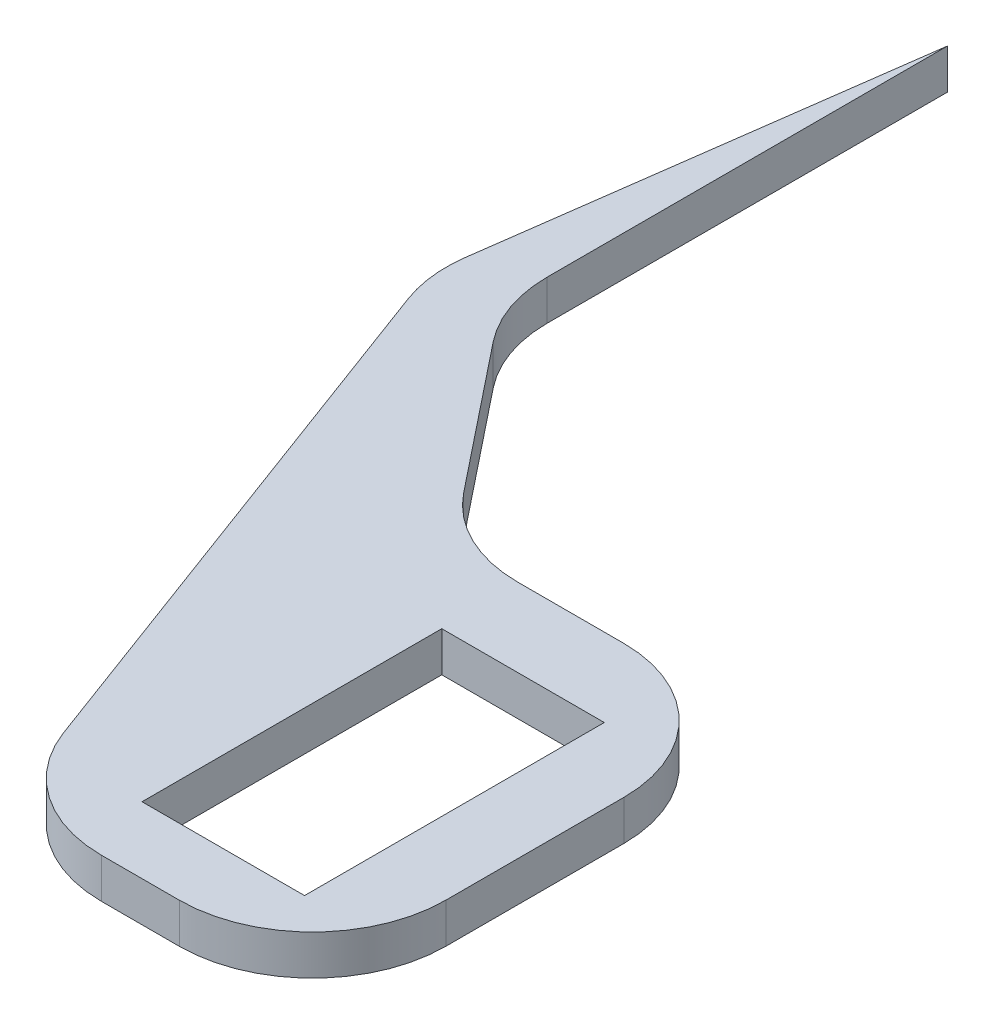
ISO-10303-21;
HEADER;
FILE_DESCRIPTION(('STEP AP214'),'2;1');
FILE_NAME('part.step','',(''),(''),'','','');
FILE_SCHEMA(('AUTOMOTIVE_DESIGN { 1 0 10303 214 1 1 1 1 }'));
ENDSEC;
DATA;
#1=APPLICATION_CONTEXT('core data for automotive mechanical design processes');
#2=APPLICATION_PROTOCOL_DEFINITION('international standard','automotive_design',2000,#1);
#3=PRODUCT_CONTEXT('',#1,'mechanical');
#4=PRODUCT('Part','Part','',(#3));
#5=PRODUCT_RELATED_PRODUCT_CATEGORY('part','',(#4));
#6=PRODUCT_DEFINITION_FORMATION('','',#4);
#7=PRODUCT_DEFINITION_CONTEXT('part definition',#1,'design');
#8=PRODUCT_DEFINITION('design','',#6,#7);
#9=PRODUCT_DEFINITION_SHAPE('','',#8);
#10=(LENGTH_UNIT() NAMED_UNIT(*) SI_UNIT(.MILLI.,.METRE.));
#11=(NAMED_UNIT(*) PLANE_ANGLE_UNIT() SI_UNIT($,.RADIAN.));
#12=(NAMED_UNIT(*) SI_UNIT($,.STERADIAN.) SOLID_ANGLE_UNIT());
#13=UNCERTAINTY_MEASURE_WITH_UNIT(LENGTH_MEASURE(1.E-05),#10,'distance_accuracy_value','');
#14=(GEOMETRIC_REPRESENTATION_CONTEXT(3) GLOBAL_UNCERTAINTY_ASSIGNED_CONTEXT((#13)) GLOBAL_UNIT_ASSIGNED_CONTEXT((#10,
#11,#12)) REPRESENTATION_CONTEXT('',''));
#15=CARTESIAN_POINT('',(0.,0.,0.));
#16=DIRECTION('',(0.,0.,1.));
#17=DIRECTION('',(1.,0.,0.));
#18=AXIS2_PLACEMENT_3D('',#15,#16,#17);
#19=CARTESIAN_POINT('',(0.,3.,0.));
#20=DIRECTION('',(0.,1.,0.));
#21=DIRECTION('',(0.,0.,1.));
#22=AXIS2_PLACEMENT_3D('',#19,#20,#21);
#23=PLANE('',#22);
#24=DIRECTION('',(-0.135315405036669,0.,0.990802574259757));
#25=VECTOR('',#24,1.);
#26=CARTESIAN_POINT('',(-25.,3.,-68.1069996913486));
#27=LINE('',#26,#25);
#28=CARTESIAN_POINT('',(-25.,3.,-68.1069996913486));
#29=VERTEX_POINT('',#28);
#30=CARTESIAN_POINT('',(-29.346151346332,3.,-36.2837350682164));
#31=VERTEX_POINT('',#30);
#32=EDGE_CURVE('E207',#29,#31,#27,.T.);
#33=ORIENTED_EDGE('',*,*,#32,.T.);
#34=CARTESIAN_POINT('',(-19.4381256037344,3.,-34.9305810178497));
#35=DIRECTION('',(0.,1.,0.));
#36=DIRECTION('',(0.,0.,1.));
#37=AXIS2_PLACEMENT_3D('',#34,#35,#36);
#38=CIRCLE('',#37,10.);
#39=CARTESIAN_POINT('',(-28.8126533332102,3.,-31.4494562212804));
#40=VERTEX_POINT('',#39);
#41=EDGE_CURVE('E254',#31,#40,#38,.T.);
#42=ORIENTED_EDGE('',*,*,#41,.T.);
#43=DIRECTION('',(0.348112479656929,0.,0.937452772947578));
#44=VECTOR('',#43,1.);
#45=CARTESIAN_POINT('',(-29.6853970801404,3.,-33.7997196948528));
#46=LINE('',#45,#44);
#47=CARTESIAN_POINT('',(-13.5207105436417,3.,9.73112479656929));
#48=VERTEX_POINT('',#47);
#49=EDGE_CURVE('E210',#40,#48,#46,.T.);
#50=ORIENTED_EDGE('',*,*,#49,.T.);
#51=CARTESIAN_POINT('',(-4.14618281416589,3.,6.25));
#52=DIRECTION('',(0.,1.,0.));
#53=DIRECTION('',(0.,0.,1.));
#54=AXIS2_PLACEMENT_3D('',#51,#52,#53);
#55=CIRCLE('',#54,10.);
#56=CARTESIAN_POINT('',(-4.14618281416589,3.,16.25));
#57=VERTEX_POINT('',#56);
#58=EDGE_CURVE('E55',#48,#57,#55,.T.);
#59=ORIENTED_EDGE('',*,*,#58,.T.);
#60=DIRECTION('',(1.,0.,0.));
#61=VECTOR('',#60,1.);
#62=CARTESIAN_POINT('',(-11.1,3.,16.25));
#63=LINE('',#62,#61);
#64=CARTESIAN_POINT('',(1.7,3.,16.25));
#65=VERTEX_POINT('',#64);
#66=EDGE_CURVE('E212',#57,#65,#63,.T.);
#67=ORIENTED_EDGE('',*,*,#66,.T.);
#68=CARTESIAN_POINT('',(1.7,3.,6.25));
#69=DIRECTION('',(0.,1.,0.));
#70=DIRECTION('',(0.,0.,1.));
#71=AXIS2_PLACEMENT_3D('',#68,#69,#70);
#72=CIRCLE('',#71,10.);
#73=CARTESIAN_POINT('',(11.7,3.,6.25));
#74=VERTEX_POINT('',#73);
#75=EDGE_CURVE('E251',#65,#74,#72,.T.);
#76=ORIENTED_EDGE('',*,*,#75,.T.);
#77=DIRECTION('',(0.,0.,-1.));
#78=VECTOR('',#77,1.);
#79=CARTESIAN_POINT('',(11.7,3.,-17.12851766219));
#80=LINE('',#79,#78);
#81=CARTESIAN_POINT('',(11.7,3.,-7.12851766219004));
#82=VERTEX_POINT('',#81);
#83=EDGE_CURVE('E195',#74,#82,#80,.T.);
#84=ORIENTED_EDGE('',*,*,#83,.T.);
#85=CARTESIAN_POINT('',(1.7,3.,-7.12851766219004));
#86=DIRECTION('',(0.,1.,0.));
#87=DIRECTION('',(0.,0.,1.));
#88=AXIS2_PLACEMENT_3D('',#85,#86,#87);
#89=CIRCLE('',#88,10.);
#90=CARTESIAN_POINT('',(1.7,3.,-17.12851766219));
#91=VERTEX_POINT('',#90);
#92=EDGE_CURVE('E249',#82,#91,#89,.T.);
#93=ORIENTED_EDGE('',*,*,#92,.T.);
#94=DIRECTION('',(-1.,0.,0.));
#95=VECTOR('',#94,1.);
#96=CARTESIAN_POINT('',(-11.1,3.,-17.12851766219));
#97=LINE('',#96,#95);
#98=CARTESIAN_POINT('',(-6.28308572289444,3.,-17.12851766219));
#99=VERTEX_POINT('',#98);
#100=EDGE_CURVE('E198',#91,#99,#97,.T.);
#101=ORIENTED_EDGE('',*,*,#100,.T.);
#102=CARTESIAN_POINT('',(-6.28308572289443,3.,-27.12851766219));
#103=DIRECTION('',(0.,1.,0.));
#104=DIRECTION('',(0.,0.,1.));
#105=AXIS2_PLACEMENT_3D('',#102,#103,#104);
#106=CIRCLE('',#105,10.);
#107=CARTESIAN_POINT('',(-14.1025827269881,3.,-20.8951023380704));
#108=VERTEX_POINT('',#107);
#109=EDGE_CURVE('E11',#99,#108,#106,.F.);
#110=ORIENTED_EDGE('',*,*,#109,.T.);
#111=DIRECTION('',(-0.62334153241197,0.,-0.781949700409366));
#112=VECTOR('',#111,1.);
#113=CARTESIAN_POINT('',(-25.,3.,-34.5653484692647));
#114=LINE('',#113,#112);
#115=CARTESIAN_POINT('',(-22.8194970040937,3.,-31.8300202812116));
#116=VERTEX_POINT('',#115);
#117=EDGE_CURVE('E202',#108,#116,#114,.T.);
#118=ORIENTED_EDGE('',*,*,#117,.T.);
#119=CARTESIAN_POINT('',(-15.,3.,-38.0634356053313));
#120=DIRECTION('',(0.,1.,0.));
#121=DIRECTION('',(0.,0.,1.));
#122=AXIS2_PLACEMENT_3D('',#119,#120,#121);
#123=CIRCLE('',#122,10.);
#124=CARTESIAN_POINT('',(-25.,3.,-38.0634356053313));
#125=VERTEX_POINT('',#124);
#126=EDGE_CURVE('E280',#116,#125,#123,.F.);
#127=ORIENTED_EDGE('',*,*,#126,.T.);
#128=DIRECTION('',(0.,0.,-1.));
#129=VECTOR('',#128,1.);
#130=CARTESIAN_POINT('',(-25.,3.,-34.5653484692647));
#131=LINE('',#130,#129);
#132=EDGE_CURVE('E205',#125,#29,#131,.T.);
#133=ORIENTED_EDGE('',*,*,#132,.T.);
#134=EDGE_LOOP('',(#33,#42,#50,#59,#67,#76,#84,#93,#101,#110,#118,#127,#133));
#135=FACE_BOUND('',#134,.T.);
#136=DIRECTION('',(-1.,0.,0.));
#137=VECTOR('',#136,1.);
#138=CARTESIAN_POINT('',(-6.1,3.,-11.25));
#139=LINE('',#138,#137);
#140=CARTESIAN_POINT('',(6.1,3.,-11.25));
#141=VERTEX_POINT('',#140);
#142=CARTESIAN_POINT('',(-6.1,3.,-11.25));
#143=VERTEX_POINT('',#142);
#144=EDGE_CURVE('E164',#141,#143,#139,.T.);
#145=ORIENTED_EDGE('',*,*,#144,.F.);
#146=DIRECTION('',(0.,0.,-1.));
#147=VECTOR('',#146,1.);
#148=CARTESIAN_POINT('',(6.1,3.,-11.25));
#149=LINE('',#148,#147);
#150=CARTESIAN_POINT('',(6.1,3.,11.25));
#151=VERTEX_POINT('',#150);
#152=EDGE_CURVE('E154',#151,#141,#149,.T.);
#153=ORIENTED_EDGE('',*,*,#152,.F.);
#154=DIRECTION('',(1.,0.,0.));
#155=VECTOR('',#154,1.);
#156=CARTESIAN_POINT('',(-6.1,3.,11.25));
#157=LINE('',#156,#155);
#158=CARTESIAN_POINT('',(-6.1,3.,11.25));
#159=VERTEX_POINT('',#158);
#160=EDGE_CURVE('E179',#159,#151,#157,.T.);
#161=ORIENTED_EDGE('',*,*,#160,.F.);
#162=DIRECTION('',(0.,0.,1.));
#163=VECTOR('',#162,1.);
#164=CARTESIAN_POINT('',(-6.1,3.,-11.25));
#165=LINE('',#164,#163);
#166=EDGE_CURVE('E177',#143,#159,#165,.T.);
#167=ORIENTED_EDGE('',*,*,#166,.F.);
#168=EDGE_LOOP('',(#145,#153,#161,#167));
#169=FACE_BOUND('',#168,.T.);
#170=ADVANCED_FACE('F33',(#135,#169),#23,.T.);
#171=CARTESIAN_POINT('',(0.,0.,0.));
#172=DIRECTION('',(0.,1.,0.));
#173=DIRECTION('',(0.,0.,1.));
#174=AXIS2_PLACEMENT_3D('',#171,#172,#173);
#175=PLANE('',#174);
#176=DIRECTION('',(0.348112479656929,0.,0.937452772947578));
#177=VECTOR('',#176,1.);
#178=CARTESIAN_POINT('',(-29.6853970801404,0.,-33.7997196948528));
#179=LINE('',#178,#177);
#180=CARTESIAN_POINT('',(-28.8126533332102,0.,-31.4494562212804));
#181=VERTEX_POINT('',#180);
#182=CARTESIAN_POINT('',(-13.5207105436417,0.,9.73112479656929));
#183=VERTEX_POINT('',#182);
#184=EDGE_CURVE('E228',#181,#183,#179,.T.);
#185=ORIENTED_EDGE('',*,*,#184,.F.);
#186=CARTESIAN_POINT('',(-19.4381256037344,0.,-34.9305810178497));
#187=DIRECTION('',(0.,1.,0.));
#188=DIRECTION('',(0.,0.,1.));
#189=AXIS2_PLACEMENT_3D('',#186,#187,#188);
#190=CIRCLE('',#189,10.);
#191=CARTESIAN_POINT('',(-29.346151346332,0.,-36.2837350682164));
#192=VERTEX_POINT('',#191);
#193=EDGE_CURVE('E245',#181,#192,#190,.F.);
#194=ORIENTED_EDGE('',*,*,#193,.T.);
#195=DIRECTION('',(-0.135315405036669,0.,0.990802574259757));
#196=VECTOR('',#195,1.);
#197=CARTESIAN_POINT('',(-25.,0.,-68.1069996913486));
#198=LINE('',#197,#196);
#199=CARTESIAN_POINT('',(-25.,0.,-68.1069996913486));
#200=VERTEX_POINT('',#199);
#201=EDGE_CURVE('E225',#200,#192,#198,.T.);
#202=ORIENTED_EDGE('',*,*,#201,.F.);
#203=DIRECTION('',(0.,0.,-1.));
#204=VECTOR('',#203,1.);
#205=CARTESIAN_POINT('',(-25.,0.,-34.5653484692647));
#206=LINE('',#205,#204);
#207=CARTESIAN_POINT('',(-25.,0.,-38.0634356053313));
#208=VERTEX_POINT('',#207);
#209=EDGE_CURVE('E223',#208,#200,#206,.T.);
#210=ORIENTED_EDGE('',*,*,#209,.F.);
#211=CARTESIAN_POINT('',(-15.,0.,-38.0634356053313));
#212=DIRECTION('',(0.,1.,0.));
#213=DIRECTION('',(0.,0.,1.));
#214=AXIS2_PLACEMENT_3D('',#211,#212,#213);
#215=CIRCLE('',#214,10.);
#216=CARTESIAN_POINT('',(-22.8194970040937,0.,-31.8300202812116));
#217=VERTEX_POINT('',#216);
#218=EDGE_CURVE('E278',#208,#217,#215,.T.);
#219=ORIENTED_EDGE('',*,*,#218,.T.);
#220=DIRECTION('',(-0.62334153241197,0.,-0.781949700409366));
#221=VECTOR('',#220,1.);
#222=CARTESIAN_POINT('',(-25.,0.,-34.5653484692647));
#223=LINE('',#222,#221);
#224=CARTESIAN_POINT('',(-14.1025827269881,0.,-20.8951023380704));
#225=VERTEX_POINT('',#224);
#226=EDGE_CURVE('E220',#225,#217,#223,.T.);
#227=ORIENTED_EDGE('',*,*,#226,.F.);
#228=CARTESIAN_POINT('',(-6.28308572289443,0.,-27.12851766219));
#229=DIRECTION('',(0.,1.,0.));
#230=DIRECTION('',(0.,0.,1.));
#231=AXIS2_PLACEMENT_3D('',#228,#229,#230);
#232=CIRCLE('',#231,10.);
#233=CARTESIAN_POINT('',(-6.28308572289444,0.,-17.12851766219));
#234=VERTEX_POINT('',#233);
#235=EDGE_CURVE('E41',#225,#234,#232,.T.);
#236=ORIENTED_EDGE('',*,*,#235,.T.);
#237=DIRECTION('',(-1.,0.,0.));
#238=VECTOR('',#237,1.);
#239=CARTESIAN_POINT('',(-11.1,0.,-17.12851766219));
#240=LINE('',#239,#238);
#241=CARTESIAN_POINT('',(1.7,0.,-17.12851766219));
#242=VERTEX_POINT('',#241);
#243=EDGE_CURVE('E217',#242,#234,#240,.T.);
#244=ORIENTED_EDGE('',*,*,#243,.F.);
#245=CARTESIAN_POINT('',(1.7,0.,-7.12851766219004));
#246=DIRECTION('',(0.,1.,0.));
#247=DIRECTION('',(0.,0.,1.));
#248=AXIS2_PLACEMENT_3D('',#245,#246,#247);
#249=CIRCLE('',#248,10.);
#250=CARTESIAN_POINT('',(11.7,0.,-7.12851766219004));
#251=VERTEX_POINT('',#250);
#252=EDGE_CURVE('E239',#242,#251,#249,.F.);
#253=ORIENTED_EDGE('',*,*,#252,.T.);
#254=DIRECTION('',(0.,0.,-1.));
#255=VECTOR('',#254,1.);
#256=CARTESIAN_POINT('',(11.7,0.,-17.12851766219));
#257=LINE('',#256,#255);
#258=CARTESIAN_POINT('',(11.7,0.,6.25));
#259=VERTEX_POINT('',#258);
#260=EDGE_CURVE('E172',#259,#251,#257,.T.);
#261=ORIENTED_EDGE('',*,*,#260,.F.);
#262=CARTESIAN_POINT('',(1.7,0.,6.25));
#263=DIRECTION('',(0.,1.,0.));
#264=DIRECTION('',(0.,0.,1.));
#265=AXIS2_PLACEMENT_3D('',#262,#263,#264);
#266=CIRCLE('',#265,10.);
#267=CARTESIAN_POINT('',(1.7,0.,16.25));
#268=VERTEX_POINT('',#267);
#269=EDGE_CURVE('E241',#259,#268,#266,.F.);
#270=ORIENTED_EDGE('',*,*,#269,.T.);
#271=DIRECTION('',(1.,0.,0.));
#272=VECTOR('',#271,1.);
#273=CARTESIAN_POINT('',(-11.1,0.,16.25));
#274=LINE('',#273,#272);
#275=CARTESIAN_POINT('',(-4.14618281416589,0.,16.25));
#276=VERTEX_POINT('',#275);
#277=EDGE_CURVE('E199',#276,#268,#274,.T.);
#278=ORIENTED_EDGE('',*,*,#277,.F.);
#279=CARTESIAN_POINT('',(-4.14618281416589,0.,6.25));
#280=DIRECTION('',(0.,1.,0.));
#281=DIRECTION('',(0.,0.,1.));
#282=AXIS2_PLACEMENT_3D('',#279,#280,#281);
#283=CIRCLE('',#282,10.);
#284=EDGE_CURVE('E243',#276,#183,#283,.F.);
#285=ORIENTED_EDGE('',*,*,#284,.T.);
#286=EDGE_LOOP('',(#185,#194,#202,#210,#219,#227,#236,#244,#253,#261,#270,#278,#285));
#287=FACE_BOUND('',#286,.T.);
#288=DIRECTION('',(0.,0.,-1.));
#289=VECTOR('',#288,1.);
#290=CARTESIAN_POINT('',(6.1,0.,-11.25));
#291=LINE('',#290,#289);
#292=CARTESIAN_POINT('',(6.1,0.,11.25));
#293=VERTEX_POINT('',#292);
#294=CARTESIAN_POINT('',(6.1,0.,-11.25));
#295=VERTEX_POINT('',#294);
#296=EDGE_CURVE('E183',#293,#295,#291,.T.);
#297=ORIENTED_EDGE('',*,*,#296,.T.);
#298=DIRECTION('',(-1.,0.,0.));
#299=VECTOR('',#298,1.);
#300=CARTESIAN_POINT('',(-6.1,0.,-11.25));
#301=LINE('',#300,#299);
#302=CARTESIAN_POINT('',(-6.1,0.,-11.25));
#303=VERTEX_POINT('',#302);
#304=EDGE_CURVE('E171',#295,#303,#301,.T.);
#305=ORIENTED_EDGE('',*,*,#304,.T.);
#306=DIRECTION('',(0.,0.,1.));
#307=VECTOR('',#306,1.);
#308=CARTESIAN_POINT('',(-6.1,0.,-11.25));
#309=LINE('',#308,#307);
#310=CARTESIAN_POINT('',(-6.1,0.,11.25));
#311=VERTEX_POINT('',#310);
#312=EDGE_CURVE('E186',#303,#311,#309,.T.);
#313=ORIENTED_EDGE('',*,*,#312,.T.);
#314=DIRECTION('',(1.,0.,0.));
#315=VECTOR('',#314,1.);
#316=CARTESIAN_POINT('',(-6.1,0.,11.25));
#317=LINE('',#316,#315);
#318=EDGE_CURVE('E165',#311,#293,#317,.T.);
#319=ORIENTED_EDGE('',*,*,#318,.T.);
#320=EDGE_LOOP('',(#297,#305,#313,#319));
#321=FACE_BOUND('',#320,.T.);
#322=ADVANCED_FACE('F285',(#287,#321),#175,.F.);
#323=CARTESIAN_POINT('',(11.7,3.,-17.12851766219));
#324=DIRECTION('',(-1.,0.,0.));
#325=DIRECTION('',(0.,0.,1.));
#326=AXIS2_PLACEMENT_3D('',#323,#324,#325);
#327=PLANE('',#326);
#328=ORIENTED_EDGE('',*,*,#83,.F.);
#329=DIRECTION('',(0.,-1.,0.));
#330=VECTOR('',#329,1.);
#331=CARTESIAN_POINT('',(11.7,3.,6.25));
#332=LINE('',#331,#330);
#333=EDGE_CURVE('E270',#74,#259,#332,.T.);
#334=ORIENTED_EDGE('',*,*,#333,.T.);
#335=ORIENTED_EDGE('',*,*,#260,.T.);
#336=DIRECTION('',(0.,-1.,0.));
#337=VECTOR('',#336,1.);
#338=CARTESIAN_POINT('',(11.7,3.,-7.12851766219004));
#339=LINE('',#338,#337);
#340=EDGE_CURVE('E268',#251,#82,#339,.F.);
#341=ORIENTED_EDGE('',*,*,#340,.T.);
#342=EDGE_LOOP('',(#328,#334,#335,#341));
#343=FACE_BOUND('',#342,.T.);
#344=ADVANCED_FACE('F334',(#343),#327,.F.);
#345=CARTESIAN_POINT('',(-11.1,3.,-17.12851766219));
#346=DIRECTION('',(0.,0.,1.));
#347=DIRECTION('',(1.,0.,0.));
#348=AXIS2_PLACEMENT_3D('',#345,#346,#347);
#349=PLANE('',#348);
#350=ORIENTED_EDGE('',*,*,#243,.T.);
#351=DIRECTION('',(0.,-1.,0.));
#352=VECTOR('',#351,1.);
#353=CARTESIAN_POINT('',(-6.28308572289444,3.,-17.12851766219));
#354=LINE('',#353,#352);
#355=EDGE_CURVE('E276',#234,#99,#354,.F.);
#356=ORIENTED_EDGE('',*,*,#355,.T.);
#357=ORIENTED_EDGE('',*,*,#100,.F.);
#358=DIRECTION('',(0.,-1.,0.));
#359=VECTOR('',#358,1.);
#360=CARTESIAN_POINT('',(1.7,3.,-17.12851766219));
#361=LINE('',#360,#359);
#362=EDGE_CURVE('E273',#91,#242,#361,.T.);
#363=ORIENTED_EDGE('',*,*,#362,.T.);
#364=EDGE_LOOP('',(#350,#356,#357,#363));
#365=FACE_BOUND('',#364,.T.);
#366=ADVANCED_FACE('F291',(#365),#349,.F.);
#367=CARTESIAN_POINT('',(-25.,3.,-34.5653484692647));
#368=DIRECTION('',(-0.781949700409366,0.,0.62334153241197));
#369=DIRECTION('',(0.62334153241197,0.,0.781949700409366));
#370=AXIS2_PLACEMENT_3D('',#367,#368,#369);
#371=PLANE('',#370);
#372=ORIENTED_EDGE('',*,*,#226,.T.);
#373=DIRECTION('',(0.,-1.,0.));
#374=VECTOR('',#373,1.);
#375=CARTESIAN_POINT('',(-22.8194970040937,3.,-31.8300202812116));
#376=LINE('',#375,#374);
#377=EDGE_CURVE('E262',#217,#116,#376,.F.);
#378=ORIENTED_EDGE('',*,*,#377,.T.);
#379=ORIENTED_EDGE('',*,*,#117,.F.);
#380=DIRECTION('',(0.,-1.,0.));
#381=VECTOR('',#380,1.);
#382=CARTESIAN_POINT('',(-14.1025827269881,0.,-20.8951023380704));
#383=LINE('',#382,#381);
#384=EDGE_CURVE('E259',#108,#225,#383,.T.);
#385=ORIENTED_EDGE('',*,*,#384,.T.);
#386=EDGE_LOOP('',(#372,#378,#379,#385));
#387=FACE_BOUND('',#386,.T.);
#388=ADVANCED_FACE('F299',(#387),#371,.F.);
#389=CARTESIAN_POINT('',(-25.,3.,-34.5653484692647));
#390=DIRECTION('',(-1.,0.,0.));
#391=DIRECTION('',(0.,0.,1.));
#392=AXIS2_PLACEMENT_3D('',#389,#390,#391);
#393=PLANE('',#392);
#394=ORIENTED_EDGE('',*,*,#132,.F.);
#395=DIRECTION('',(0.,-1.,0.));
#396=VECTOR('',#395,1.);
#397=CARTESIAN_POINT('',(-25.,0.,-38.0634356053313));
#398=LINE('',#397,#396);
#399=EDGE_CURVE('E256',#125,#208,#398,.T.);
#400=ORIENTED_EDGE('',*,*,#399,.T.);
#401=ORIENTED_EDGE('',*,*,#209,.T.);
#402=DIRECTION('',(0.,-1.,0.));
#403=VECTOR('',#402,1.);
#404=CARTESIAN_POINT('',(-25.,3.,-68.1069996913486));
#405=LINE('',#404,#403);
#406=EDGE_CURVE('E214',#29,#200,#405,.T.);
#407=ORIENTED_EDGE('',*,*,#406,.F.);
#408=EDGE_LOOP('',(#394,#400,#401,#407));
#409=FACE_BOUND('',#408,.T.);
#410=ADVANCED_FACE('F307',(#409),#393,.F.);
#411=CARTESIAN_POINT('',(-25.,3.,-68.1069996913486));
#412=DIRECTION('',(0.990802574259757,0.,0.135315405036669));
#413=DIRECTION('',(0.135315405036669,0.,-0.990802574259757));
#414=AXIS2_PLACEMENT_3D('',#411,#412,#413);
#415=PLANE('',#414);
#416=ORIENTED_EDGE('',*,*,#201,.T.);
#417=DIRECTION('',(0.,-1.,0.));
#418=VECTOR('',#417,1.);
#419=CARTESIAN_POINT('',(-29.346151346332,3.,-36.2837350682164));
#420=LINE('',#419,#418);
#421=EDGE_CURVE('E247',#192,#31,#420,.F.);
#422=ORIENTED_EDGE('',*,*,#421,.T.);
#423=ORIENTED_EDGE('',*,*,#32,.F.);
#424=ORIENTED_EDGE('',*,*,#406,.T.);
#425=EDGE_LOOP('',(#416,#422,#423,#424));
#426=FACE_BOUND('',#425,.T.);
#427=ADVANCED_FACE('F312',(#426),#415,.F.);
#428=CARTESIAN_POINT('',(-29.6853970801404,3.,-33.7997196948528));
#429=DIRECTION('',(0.937452772947578,0.,-0.348112479656929));
#430=DIRECTION('',(-0.348112479656929,0.,-0.937452772947579));
#431=AXIS2_PLACEMENT_3D('',#428,#429,#430);
#432=PLANE('',#431);
#433=ORIENTED_EDGE('',*,*,#49,.F.);
#434=DIRECTION('',(0.,-1.,0.));
#435=VECTOR('',#434,1.);
#436=CARTESIAN_POINT('',(-28.8126533332102,3.,-31.4494562212804));
#437=LINE('',#436,#435);
#438=EDGE_CURVE('E236',#40,#181,#437,.T.);
#439=ORIENTED_EDGE('',*,*,#438,.T.);
#440=ORIENTED_EDGE('',*,*,#184,.T.);
#441=DIRECTION('',(0.,-1.,0.));
#442=VECTOR('',#441,1.);
#443=CARTESIAN_POINT('',(-13.5207105436417,3.,9.73112479656929));
#444=LINE('',#443,#442);
#445=EDGE_CURVE('E234',#183,#48,#444,.F.);
#446=ORIENTED_EDGE('',*,*,#445,.T.);
#447=EDGE_LOOP('',(#433,#439,#440,#446));
#448=FACE_BOUND('',#447,.T.);
#449=ADVANCED_FACE('F320',(#448),#432,.F.);
#450=CARTESIAN_POINT('',(-11.1,3.,16.25));
#451=DIRECTION('',(0.,0.,-1.));
#452=DIRECTION('',(-1.,0.,0.));
#453=AXIS2_PLACEMENT_3D('',#450,#451,#452);
#454=PLANE('',#453);
#455=ORIENTED_EDGE('',*,*,#66,.F.);
#456=DIRECTION('',(0.,-1.,0.));
#457=VECTOR('',#456,1.);
#458=CARTESIAN_POINT('',(-4.14618281416589,3.,16.25));
#459=LINE('',#458,#457);
#460=EDGE_CURVE('E265',#57,#276,#459,.T.);
#461=ORIENTED_EDGE('',*,*,#460,.T.);
#462=ORIENTED_EDGE('',*,*,#277,.T.);
#463=DIRECTION('',(0.,-1.,0.));
#464=VECTOR('',#463,1.);
#465=CARTESIAN_POINT('',(1.7,3.,16.25));
#466=LINE('',#465,#464);
#467=EDGE_CURVE('E48',#268,#65,#466,.F.);
#468=ORIENTED_EDGE('',*,*,#467,.T.);
#469=EDGE_LOOP('',(#455,#461,#462,#468));
#470=FACE_BOUND('',#469,.T.);
#471=ADVANCED_FACE('F326',(#470),#454,.F.);
#472=CARTESIAN_POINT('',(6.1,3.,-11.25));
#473=DIRECTION('',(-1.,0.,0.));
#474=DIRECTION('',(0.,0.,1.));
#475=AXIS2_PLACEMENT_3D('',#472,#473,#474);
#476=PLANE('',#475);
#477=ORIENTED_EDGE('',*,*,#296,.F.);
#478=DIRECTION('',(0.,-1.,0.));
#479=VECTOR('',#478,1.);
#480=CARTESIAN_POINT('',(6.1,3.,11.25));
#481=LINE('',#480,#479);
#482=EDGE_CURVE('E160',#151,#293,#481,.T.);
#483=ORIENTED_EDGE('',*,*,#482,.F.);
#484=ORIENTED_EDGE('',*,*,#152,.T.);
#485=DIRECTION('',(0.,-1.,0.));
#486=VECTOR('',#485,1.);
#487=CARTESIAN_POINT('',(6.1,3.,-11.25));
#488=LINE('',#487,#486);
#489=EDGE_CURVE('E157',#141,#295,#488,.T.);
#490=ORIENTED_EDGE('',*,*,#489,.T.);
#491=EDGE_LOOP('',(#477,#483,#484,#490));
#492=FACE_BOUND('',#491,.T.);
#493=ADVANCED_FACE('F156',(#492),#476,.T.);
#494=CARTESIAN_POINT('',(-6.1,3.,-11.25));
#495=DIRECTION('',(0.,0.,1.));
#496=DIRECTION('',(1.,0.,0.));
#497=AXIS2_PLACEMENT_3D('',#494,#495,#496);
#498=PLANE('',#497);
#499=ORIENTED_EDGE('',*,*,#304,.F.);
#500=ORIENTED_EDGE('',*,*,#489,.F.);
#501=ORIENTED_EDGE('',*,*,#144,.T.);
#502=DIRECTION('',(0.,-1.,0.));
#503=VECTOR('',#502,1.);
#504=CARTESIAN_POINT('',(-6.1,3.,-11.25));
#505=LINE('',#504,#503);
#506=EDGE_CURVE('E173',#143,#303,#505,.T.);
#507=ORIENTED_EDGE('',*,*,#506,.T.);
#508=EDGE_LOOP('',(#499,#500,#501,#507));
#509=FACE_BOUND('',#508,.T.);
#510=ADVANCED_FACE('F168',(#509),#498,.T.);
#511=CARTESIAN_POINT('',(-6.1,3.,-11.25));
#512=DIRECTION('',(1.,0.,0.));
#513=DIRECTION('',(0.,0.,-1.));
#514=AXIS2_PLACEMENT_3D('',#511,#512,#513);
#515=PLANE('',#514);
#516=ORIENTED_EDGE('',*,*,#312,.F.);
#517=ORIENTED_EDGE('',*,*,#506,.F.);
#518=ORIENTED_EDGE('',*,*,#166,.T.);
#519=DIRECTION('',(0.,-1.,0.));
#520=VECTOR('',#519,1.);
#521=CARTESIAN_POINT('',(-6.1,3.,11.25));
#522=LINE('',#521,#520);
#523=EDGE_CURVE('E192',#159,#311,#522,.T.);
#524=ORIENTED_EDGE('',*,*,#523,.T.);
#525=EDGE_LOOP('',(#516,#517,#518,#524));
#526=FACE_BOUND('',#525,.T.);
#527=ADVANCED_FACE('F412',(#526),#515,.T.);
#528=CARTESIAN_POINT('',(-6.1,3.,11.25));
#529=DIRECTION('',(0.,0.,-1.));
#530=DIRECTION('',(-1.,0.,0.));
#531=AXIS2_PLACEMENT_3D('',#528,#529,#530);
#532=PLANE('',#531);
#533=ORIENTED_EDGE('',*,*,#318,.F.);
#534=ORIENTED_EDGE('',*,*,#523,.F.);
#535=ORIENTED_EDGE('',*,*,#160,.T.);
#536=ORIENTED_EDGE('',*,*,#482,.T.);
#537=EDGE_LOOP('',(#533,#534,#535,#536));
#538=FACE_BOUND('',#537,.T.);
#539=ADVANCED_FACE('F367',(#538),#532,.T.);
#540=CARTESIAN_POINT('',(-19.4381256037344,3.,-34.9305810178497));
#541=DIRECTION('',(0.,-1.,0.));
#542=DIRECTION('',(0.,0.,-1.));
#543=AXIS2_PLACEMENT_3D('',#540,#541,#542);
#544=CYLINDRICAL_SURFACE('',#543,10.);
#545=ORIENTED_EDGE('',*,*,#41,.F.);
#546=ORIENTED_EDGE('',*,*,#421,.F.);
#547=ORIENTED_EDGE('',*,*,#193,.F.);
#548=ORIENTED_EDGE('',*,*,#438,.F.);
#549=EDGE_LOOP('',(#545,#546,#547,#548));
#550=FACE_BOUND('',#549,.T.);
#551=ADVANCED_FACE('F318',(#550),#544,.T.);
#552=CARTESIAN_POINT('',(-15.,3.,-38.0634356053313));
#553=DIRECTION('',(0.,1.,0.));
#554=DIRECTION('',(0.,0.,1.));
#555=AXIS2_PLACEMENT_3D('',#552,#553,#554);
#556=CYLINDRICAL_SURFACE('',#555,10.);
#557=ORIENTED_EDGE('',*,*,#126,.F.);
#558=ORIENTED_EDGE('',*,*,#377,.F.);
#559=ORIENTED_EDGE('',*,*,#218,.F.);
#560=ORIENTED_EDGE('',*,*,#399,.F.);
#561=EDGE_LOOP('',(#557,#558,#559,#560));
#562=FACE_BOUND('',#561,.T.);
#563=ADVANCED_FACE('F302',(#562),#556,.F.);
#564=CARTESIAN_POINT('',(-4.14618281416589,3.,6.25));
#565=DIRECTION('',(0.,-1.,0.));
#566=DIRECTION('',(0.,0.,-1.));
#567=AXIS2_PLACEMENT_3D('',#564,#565,#566);
#568=CYLINDRICAL_SURFACE('',#567,10.);
#569=ORIENTED_EDGE('',*,*,#58,.F.);
#570=ORIENTED_EDGE('',*,*,#445,.F.);
#571=ORIENTED_EDGE('',*,*,#284,.F.);
#572=ORIENTED_EDGE('',*,*,#460,.F.);
#573=EDGE_LOOP('',(#569,#570,#571,#572));
#574=FACE_BOUND('',#573,.T.);
#575=ADVANCED_FACE('F325',(#574),#568,.T.);
#576=CARTESIAN_POINT('',(1.7,3.,6.25));
#577=DIRECTION('',(0.,-1.,0.));
#578=DIRECTION('',(0.,0.,-1.));
#579=AXIS2_PLACEMENT_3D('',#576,#577,#578);
#580=CYLINDRICAL_SURFACE('',#579,10.);
#581=ORIENTED_EDGE('',*,*,#75,.F.);
#582=ORIENTED_EDGE('',*,*,#467,.F.);
#583=ORIENTED_EDGE('',*,*,#269,.F.);
#584=ORIENTED_EDGE('',*,*,#333,.F.);
#585=EDGE_LOOP('',(#581,#582,#583,#584));
#586=FACE_BOUND('',#585,.T.);
#587=ADVANCED_FACE('F331',(#586),#580,.T.);
#588=CARTESIAN_POINT('',(-6.28308572289443,3.,-27.12851766219));
#589=DIRECTION('',(0.,1.,0.));
#590=DIRECTION('',(0.,0.,1.));
#591=AXIS2_PLACEMENT_3D('',#588,#589,#590);
#592=CYLINDRICAL_SURFACE('',#591,10.);
#593=ORIENTED_EDGE('',*,*,#109,.F.);
#594=ORIENTED_EDGE('',*,*,#355,.F.);
#595=ORIENTED_EDGE('',*,*,#235,.F.);
#596=ORIENTED_EDGE('',*,*,#384,.F.);
#597=EDGE_LOOP('',(#593,#594,#595,#596));
#598=FACE_BOUND('',#597,.T.);
#599=ADVANCED_FACE('F295',(#598),#592,.F.);
#600=CARTESIAN_POINT('',(1.7,3.,-7.12851766219004));
#601=DIRECTION('',(0.,-1.,0.));
#602=DIRECTION('',(0.,0.,-1.));
#603=AXIS2_PLACEMENT_3D('',#600,#601,#602);
#604=CYLINDRICAL_SURFACE('',#603,10.);
#605=ORIENTED_EDGE('',*,*,#92,.F.);
#606=ORIENTED_EDGE('',*,*,#340,.F.);
#607=ORIENTED_EDGE('',*,*,#252,.F.);
#608=ORIENTED_EDGE('',*,*,#362,.F.);
#609=EDGE_LOOP('',(#605,#606,#607,#608));
#610=FACE_BOUND('',#609,.T.);
#611=ADVANCED_FACE('F35',(#610),#604,.T.);
#612=CLOSED_SHELL('',(#170,#322,#344,#366,#388,#410,#427,#449,#471,#493,#510,#527,#539,#551,
#563,#575,#587,#599,#611));
#613=MANIFOLD_SOLID_BREP('B2',#612);
#614=ADVANCED_BREP_SHAPE_REPRESENTATION('',(#18,#613),#14);
#615=SHAPE_DEFINITION_REPRESENTATION(#9,#614);
ENDSEC;
END-ISO-10303-21;
